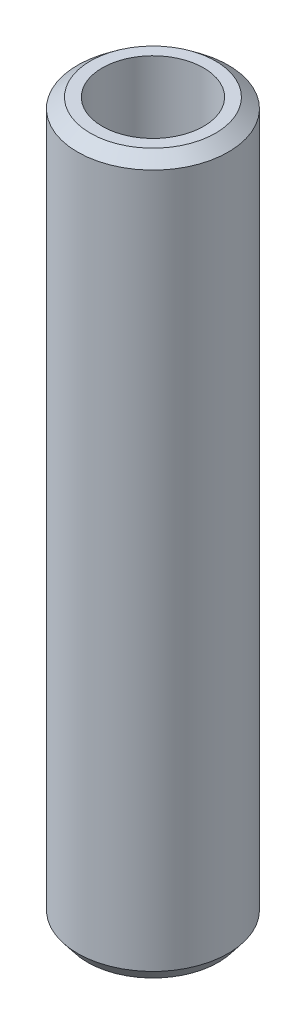
ISO-10303-21;
HEADER;
FILE_DESCRIPTION(('STEP AP214'),'2;1');
FILE_NAME('part.step','',(''),(''),'','','');
FILE_SCHEMA(('AUTOMOTIVE_DESIGN { 1 0 10303 214 1 1 1 1 }'));
ENDSEC;
DATA;
#1=APPLICATION_CONTEXT('core data for automotive mechanical design processes');
#2=APPLICATION_PROTOCOL_DEFINITION('international standard','automotive_design',2000,#1);
#3=PRODUCT_CONTEXT('',#1,'mechanical');
#4=PRODUCT('Part','Part','',(#3));
#5=PRODUCT_RELATED_PRODUCT_CATEGORY('part','',(#4));
#6=PRODUCT_DEFINITION_FORMATION('','',#4);
#7=PRODUCT_DEFINITION_CONTEXT('part definition',#1,'design');
#8=PRODUCT_DEFINITION('design','',#6,#7);
#9=PRODUCT_DEFINITION_SHAPE('','',#8);
#10=(LENGTH_UNIT() NAMED_UNIT(*) SI_UNIT(.MILLI.,.METRE.));
#11=(NAMED_UNIT(*) PLANE_ANGLE_UNIT() SI_UNIT($,.RADIAN.));
#12=(NAMED_UNIT(*) SI_UNIT($,.STERADIAN.) SOLID_ANGLE_UNIT());
#13=UNCERTAINTY_MEASURE_WITH_UNIT(LENGTH_MEASURE(1.E-05),#10,'distance_accuracy_value','');
#14=(GEOMETRIC_REPRESENTATION_CONTEXT(3) GLOBAL_UNCERTAINTY_ASSIGNED_CONTEXT((#13)) GLOBAL_UNIT_ASSIGNED_CONTEXT((#10,
#11,#12)) REPRESENTATION_CONTEXT('',''));
#15=CARTESIAN_POINT('',(0.,0.,0.));
#16=DIRECTION('',(0.,0.,1.));
#17=DIRECTION('',(1.,0.,0.));
#18=AXIS2_PLACEMENT_3D('',#15,#16,#17);
#19=CARTESIAN_POINT('',(0.,380.489459649728,0.));
#20=DIRECTION('',(0.,-1.,0.));
#21=DIRECTION('',(0.,0.,-1.));
#22=AXIS2_PLACEMENT_3D('',#19,#20,#21);
#23=CYLINDRICAL_SURFACE('',#22,40.);
#24=CARTESIAN_POINT('',(0.,375.197290770155,0.));
#25=DIRECTION('',(0.,1.,0.));
#26=DIRECTION('',(0.,0.,1.));
#27=AXIS2_PLACEMENT_3D('',#24,#25,#26);
#28=CIRCLE('',#27,40.);
#29=CARTESIAN_POINT('',(0.,375.197290770155,40.));
#30=VERTEX_POINT('',#29);
#31=EDGE_CURVE('E50',#30,#30,#28,.F.);
#32=ORIENTED_EDGE('',*,*,#31,.T.);
#33=EDGE_LOOP('',(#32));
#34=FACE_BOUND('',#33,.T.);
#35=CARTESIAN_POINT('',(0.,6.77115704498959,0.));
#36=DIRECTION('',(0.,1.,0.));
#37=DIRECTION('',(0.,0.,1.));
#38=AXIS2_PLACEMENT_3D('',#35,#36,#37);
#39=CIRCLE('',#38,40.);
#40=CARTESIAN_POINT('',(0.,6.77115704498959,40.));
#41=VERTEX_POINT('',#40);
#42=EDGE_CURVE('E51',#41,#41,#39,.T.);
#43=ORIENTED_EDGE('',*,*,#42,.T.);
#44=EDGE_LOOP('',(#43));
#45=FACE_BOUND('',#44,.T.);
#46=ADVANCED_FACE('F39',(#34,#45),#23,.T.);
#47=CARTESIAN_POINT('',(0.,380.489459649728,0.));
#48=DIRECTION('',(0.,1.,0.));
#49=DIRECTION('',(0.,0.,1.));
#50=AXIS2_PLACEMENT_3D('',#47,#48,#49);
#51=PLANE('',#50);
#52=CARTESIAN_POINT('',(0.,380.489459649728,0.));
#53=DIRECTION('',(0.,1.,0.));
#54=DIRECTION('',(0.,0.,1.));
#55=AXIS2_PLACEMENT_3D('',#52,#53,#54);
#56=CIRCLE('',#55,33.2288429550104);
#57=CARTESIAN_POINT('',(0.,380.489459649728,33.2288429550104));
#58=VERTEX_POINT('',#57);
#59=EDGE_CURVE('E54',#58,#58,#56,.T.);
#60=ORIENTED_EDGE('',*,*,#59,.T.);
#61=EDGE_LOOP('',(#60));
#62=FACE_BOUND('',#61,.T.);
#63=CARTESIAN_POINT('',(0.,380.489459649728,0.));
#64=DIRECTION('',(0.,1.,0.));
#65=DIRECTION('',(0.,0.,1.));
#66=AXIS2_PLACEMENT_3D('',#63,#64,#65);
#67=CIRCLE('',#66,26.9064849868104);
#68=CARTESIAN_POINT('',(0.,380.489459649728,26.9064849868104));
#69=VERTEX_POINT('',#68);
#70=EDGE_CURVE('E58',#69,#69,#67,.T.);
#71=ORIENTED_EDGE('',*,*,#70,.F.);
#72=EDGE_LOOP('',(#71));
#73=FACE_BOUND('',#72,.T.);
#74=ADVANCED_FACE('F69',(#62,#73),#51,.T.);
#75=CARTESIAN_POINT('',(0.,0.,0.));
#76=DIRECTION('',(0.,1.,0.));
#77=DIRECTION('',(0.,0.,1.));
#78=AXIS2_PLACEMENT_3D('',#75,#76,#77);
#79=PLANE('',#78);
#80=CARTESIAN_POINT('',(0.,0.,0.));
#81=DIRECTION('',(0.,1.,0.));
#82=DIRECTION('',(0.,0.,1.));
#83=AXIS2_PLACEMENT_3D('',#80,#81,#82);
#84=CIRCLE('',#83,34.7078311204276);
#85=CARTESIAN_POINT('',(0.,0.,34.7078311204276));
#86=VERTEX_POINT('',#85);
#87=EDGE_CURVE('E10',#86,#86,#84,.F.);
#88=ORIENTED_EDGE('',*,*,#87,.T.);
#89=EDGE_LOOP('',(#88));
#90=FACE_BOUND('',#89,.T.);
#91=CARTESIAN_POINT('',(0.,0.,0.));
#92=DIRECTION('',(0.,1.,0.));
#93=DIRECTION('',(0.,0.,1.));
#94=AXIS2_PLACEMENT_3D('',#91,#92,#93);
#95=CIRCLE('',#94,26.9064849868104);
#96=CARTESIAN_POINT('',(0.,0.,26.9064849868104));
#97=VERTEX_POINT('',#96);
#98=EDGE_CURVE('E63',#97,#97,#95,.T.);
#99=ORIENTED_EDGE('',*,*,#98,.T.);
#100=EDGE_LOOP('',(#99));
#101=FACE_BOUND('',#100,.T.);
#102=ADVANCED_FACE('F75',(#90,#101),#79,.F.);
#103=CARTESIAN_POINT('',(0.,380.489459649728,0.));
#104=DIRECTION('',(0.,-1.,0.));
#105=DIRECTION('',(0.,0.,-1.));
#106=AXIS2_PLACEMENT_3D('',#103,#104,#105);
#107=CYLINDRICAL_SURFACE('',#106,26.9064849868104);
#108=ORIENTED_EDGE('',*,*,#70,.T.);
#109=EDGE_LOOP('',(#108));
#110=FACE_BOUND('',#109,.T.);
#111=ORIENTED_EDGE('',*,*,#98,.F.);
#112=EDGE_LOOP('',(#111));
#113=FACE_BOUND('',#112,.T.);
#114=ADVANCED_FACE('F70',(#110,#113),#107,.F.);
#115=CARTESIAN_POINT('',(0.,380.489459649728,0.));
#116=DIRECTION('',(0.,-1.,0.));
#117=DIRECTION('',(0.,0.,-1.));
#118=AXIS2_PLACEMENT_3D('',#115,#116,#117);
#119=CONICAL_SURFACE('',#118,33.2288429550104,0.907391380484881);
#120=ORIENTED_EDGE('',*,*,#31,.F.);
#121=EDGE_LOOP('',(#120));
#122=FACE_BOUND('',#121,.T.);
#123=ORIENTED_EDGE('',*,*,#59,.F.);
#124=EDGE_LOOP('',(#123));
#125=FACE_BOUND('',#124,.T.);
#126=ADVANCED_FACE('F81',(#122,#125),#119,.T.);
#127=CARTESIAN_POINT('',(0.,6.77115704498959,0.));
#128=DIRECTION('',(0.,1.,0.));
#129=DIRECTION('',(0.,0.,1.));
#130=AXIS2_PLACEMENT_3D('',#127,#128,#129);
#131=CONICAL_SURFACE('',#130,40.,0.663404946310016);
#132=ORIENTED_EDGE('',*,*,#87,.F.);
#133=EDGE_LOOP('',(#132));
#134=FACE_BOUND('',#133,.T.);
#135=ORIENTED_EDGE('',*,*,#42,.F.);
#136=EDGE_LOOP('',(#135));
#137=FACE_BOUND('',#136,.T.);
#138=ADVANCED_FACE('F45',(#134,#137),#131,.T.);
#139=CLOSED_SHELL('',(#46,#74,#102,#114,#126,#138));
#140=MANIFOLD_SOLID_BREP('B2',#139);
#141=ADVANCED_BREP_SHAPE_REPRESENTATION('',(#18,#140),#14);
#142=SHAPE_DEFINITION_REPRESENTATION(#9,#141);
ENDSEC;
END-ISO-10303-21;
